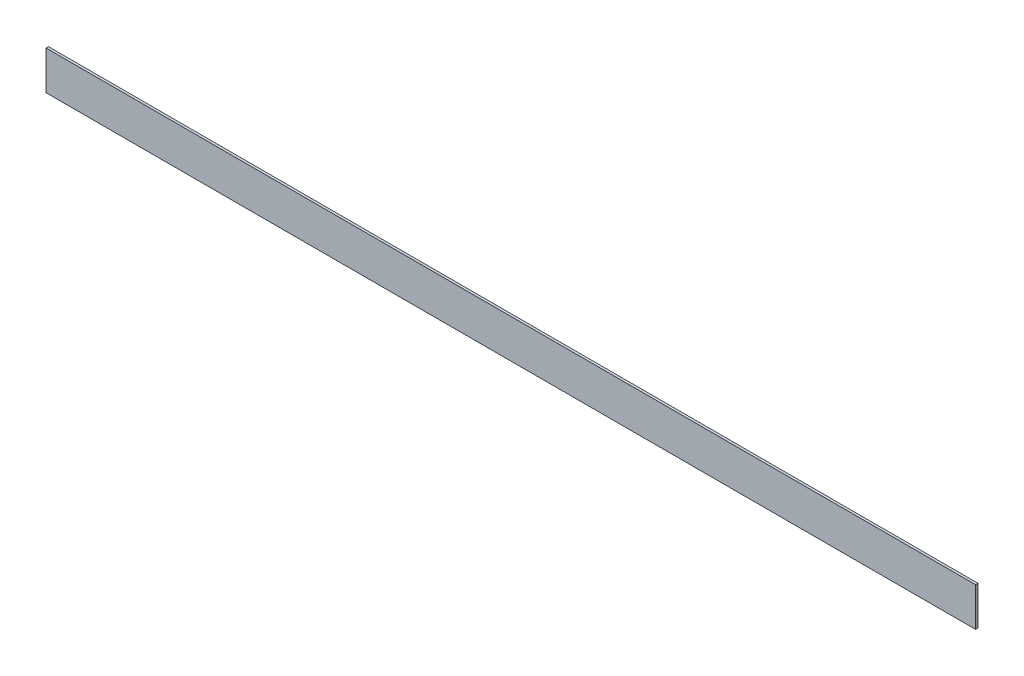
ISO-10303-21;
HEADER;
FILE_DESCRIPTION(('STEP AP214'),'2;1');
FILE_NAME('part.step','',(''),(''),'','','');
FILE_SCHEMA(('AUTOMOTIVE_DESIGN { 1 0 10303 214 1 1 1 1 }'));
ENDSEC;
DATA;
#1=APPLICATION_CONTEXT('core data for automotive mechanical design processes');
#2=APPLICATION_PROTOCOL_DEFINITION('international standard','automotive_design',2000,#1);
#3=PRODUCT_CONTEXT('',#1,'mechanical');
#4=PRODUCT('Part','Part','',(#3));
#5=PRODUCT_RELATED_PRODUCT_CATEGORY('part','',(#4));
#6=PRODUCT_DEFINITION_FORMATION('','',#4);
#7=PRODUCT_DEFINITION_CONTEXT('part definition',#1,'design');
#8=PRODUCT_DEFINITION('design','',#6,#7);
#9=PRODUCT_DEFINITION_SHAPE('','',#8);
#10=(LENGTH_UNIT() NAMED_UNIT(*) SI_UNIT(.MILLI.,.METRE.));
#11=(NAMED_UNIT(*) PLANE_ANGLE_UNIT() SI_UNIT($,.RADIAN.));
#12=(NAMED_UNIT(*) SI_UNIT($,.STERADIAN.) SOLID_ANGLE_UNIT());
#13=UNCERTAINTY_MEASURE_WITH_UNIT(LENGTH_MEASURE(1.E-05),#10,'distance_accuracy_value','');
#14=(GEOMETRIC_REPRESENTATION_CONTEXT(3) GLOBAL_UNCERTAINTY_ASSIGNED_CONTEXT((#13)) GLOBAL_UNIT_ASSIGNED_CONTEXT((#10,
#11,#12)) REPRESENTATION_CONTEXT('',''));
#15=CARTESIAN_POINT('',(0.,0.,0.));
#16=DIRECTION('',(0.,0.,1.));
#17=DIRECTION('',(1.,0.,0.));
#18=AXIS2_PLACEMENT_3D('',#15,#16,#17);
#19=CARTESIAN_POINT('',(304.8,12.7,1.58749999999985));
#20=DIRECTION('',(-1.,0.,0.));
#21=DIRECTION('',(0.,0.,1.));
#22=AXIS2_PLACEMENT_3D('',#19,#20,#21);
#23=PLANE('',#22);
#24=DIRECTION('',(0.,1.,0.));
#25=VECTOR('',#24,1.);
#26=CARTESIAN_POINT('',(304.8,12.7,0.));
#27=LINE('',#26,#25);
#28=CARTESIAN_POINT('',(304.8,-12.7,0.));
#29=VERTEX_POINT('',#28);
#30=CARTESIAN_POINT('',(304.8,12.7,0.));
#31=VERTEX_POINT('',#30);
#32=EDGE_CURVE('E95',#29,#31,#27,.T.);
#33=ORIENTED_EDGE('',*,*,#32,.T.);
#34=DIRECTION('',(0.,0.,-1.));
#35=VECTOR('',#34,1.);
#36=CARTESIAN_POINT('',(304.8,12.7,1.58749999999985));
#37=LINE('',#36,#35);
#38=CARTESIAN_POINT('',(304.8,12.7,1.58749999999985));
#39=VERTEX_POINT('',#38);
#40=EDGE_CURVE('E11',#39,#31,#37,.T.);
#41=ORIENTED_EDGE('',*,*,#40,.F.);
#42=DIRECTION('',(0.,1.,0.));
#43=VECTOR('',#42,1.);
#44=CARTESIAN_POINT('',(304.8,12.7,1.58749999999985));
#45=LINE('',#44,#43);
#46=CARTESIAN_POINT('',(304.8,-12.7,1.58749999999985));
#47=VERTEX_POINT('',#46);
#48=EDGE_CURVE('E83',#47,#39,#45,.T.);
#49=ORIENTED_EDGE('',*,*,#48,.F.);
#50=DIRECTION('',(0.,0.,-1.));
#51=VECTOR('',#50,1.);
#52=CARTESIAN_POINT('',(304.8,-12.7,1.58749999999985));
#53=LINE('',#52,#51);
#54=EDGE_CURVE('E91',#47,#29,#53,.T.);
#55=ORIENTED_EDGE('',*,*,#54,.T.);
#56=EDGE_LOOP('',(#33,#41,#49,#55));
#57=FACE_BOUND('',#56,.T.);
#58=ADVANCED_FACE('F32',(#57),#23,.F.);
#59=CARTESIAN_POINT('',(-304.8,12.7,1.58749999999985));
#60=DIRECTION('',(0.,-1.,0.));
#61=DIRECTION('',(0.,0.,-1.));
#62=AXIS2_PLACEMENT_3D('',#59,#60,#61);
#63=PLANE('',#62);
#64=DIRECTION('',(-1.,0.,0.));
#65=VECTOR('',#64,1.);
#66=CARTESIAN_POINT('',(-304.8,12.7,-2.22044604925031E-13));
#67=LINE('',#66,#65);
#68=CARTESIAN_POINT('',(-304.8,12.7,-2.22044604925031E-13));
#69=VERTEX_POINT('',#68);
#70=EDGE_CURVE('E87',#31,#69,#67,.T.);
#71=ORIENTED_EDGE('',*,*,#70,.T.);
#72=DIRECTION('',(0.,0.,-1.));
#73=VECTOR('',#72,1.);
#74=CARTESIAN_POINT('',(-304.8,12.7,1.58749999999985));
#75=LINE('',#74,#73);
#76=CARTESIAN_POINT('',(-304.8,12.7,1.58749999999985));
#77=VERTEX_POINT('',#76);
#78=EDGE_CURVE('E40',#77,#69,#75,.T.);
#79=ORIENTED_EDGE('',*,*,#78,.F.);
#80=DIRECTION('',(-1.,0.,0.));
#81=VECTOR('',#80,1.);
#82=CARTESIAN_POINT('',(-304.8,12.7,1.58749999999985));
#83=LINE('',#82,#81);
#84=EDGE_CURVE('E78',#39,#77,#83,.T.);
#85=ORIENTED_EDGE('',*,*,#84,.F.);
#86=ORIENTED_EDGE('',*,*,#40,.T.);
#87=EDGE_LOOP('',(#71,#79,#85,#86));
#88=FACE_BOUND('',#87,.T.);
#89=ADVANCED_FACE('F86',(#88),#63,.F.);
#90=CARTESIAN_POINT('',(-304.8,12.7,1.58749999999985));
#91=DIRECTION('',(1.,0.,0.));
#92=DIRECTION('',(0.,0.,-1.));
#93=AXIS2_PLACEMENT_3D('',#90,#91,#92);
#94=PLANE('',#93);
#95=DIRECTION('',(0.,-1.,0.));
#96=VECTOR('',#95,1.);
#97=CARTESIAN_POINT('',(-304.8,12.7,-2.22044604925031E-13));
#98=LINE('',#97,#96);
#99=CARTESIAN_POINT('',(-304.8,-12.7,-2.22044604925031E-13));
#100=VERTEX_POINT('',#99);
#101=EDGE_CURVE('E65',#69,#100,#98,.T.);
#102=ORIENTED_EDGE('',*,*,#101,.T.);
#103=DIRECTION('',(0.,0.,-1.));
#104=VECTOR('',#103,1.);
#105=CARTESIAN_POINT('',(-304.8,-12.7,1.58749999999985));
#106=LINE('',#105,#104);
#107=CARTESIAN_POINT('',(-304.8,-12.7,1.58749999999985));
#108=VERTEX_POINT('',#107);
#109=EDGE_CURVE('E88',#108,#100,#106,.T.);
#110=ORIENTED_EDGE('',*,*,#109,.F.);
#111=DIRECTION('',(0.,-1.,0.));
#112=VECTOR('',#111,1.);
#113=CARTESIAN_POINT('',(-304.8,12.7,1.58749999999985));
#114=LINE('',#113,#112);
#115=EDGE_CURVE('E81',#77,#108,#114,.T.);
#116=ORIENTED_EDGE('',*,*,#115,.F.);
#117=ORIENTED_EDGE('',*,*,#78,.T.);
#118=EDGE_LOOP('',(#102,#110,#116,#117));
#119=FACE_BOUND('',#118,.T.);
#120=ADVANCED_FACE('F89',(#119),#94,.F.);
#121=CARTESIAN_POINT('',(-304.8,-12.7,1.58749999999985));
#122=DIRECTION('',(0.,1.,0.));
#123=DIRECTION('',(0.,0.,1.));
#124=AXIS2_PLACEMENT_3D('',#121,#122,#123);
#125=PLANE('',#124);
#126=DIRECTION('',(1.,0.,0.));
#127=VECTOR('',#126,1.);
#128=CARTESIAN_POINT('',(-304.8,-12.7,-2.22044604925031E-13));
#129=LINE('',#128,#127);
#130=EDGE_CURVE('E71',#100,#29,#129,.T.);
#131=ORIENTED_EDGE('',*,*,#130,.T.);
#132=ORIENTED_EDGE('',*,*,#54,.F.);
#133=DIRECTION('',(1.,0.,0.));
#134=VECTOR('',#133,1.);
#135=CARTESIAN_POINT('',(-304.8,-12.7,1.58749999999985));
#136=LINE('',#135,#134);
#137=EDGE_CURVE('E48',#108,#47,#136,.T.);
#138=ORIENTED_EDGE('',*,*,#137,.F.);
#139=ORIENTED_EDGE('',*,*,#109,.T.);
#140=EDGE_LOOP('',(#131,#132,#138,#139));
#141=FACE_BOUND('',#140,.T.);
#142=ADVANCED_FACE('F102',(#141),#125,.F.);
#143=CARTESIAN_POINT('',(0.,0.,1.58749999999963));
#144=DIRECTION('',(0.,0.,1.));
#145=DIRECTION('',(1.,0.,0.));
#146=AXIS2_PLACEMENT_3D('',#143,#144,#145);
#147=PLANE('',#146);
#148=ORIENTED_EDGE('',*,*,#48,.T.);
#149=ORIENTED_EDGE('',*,*,#84,.T.);
#150=ORIENTED_EDGE('',*,*,#115,.T.);
#151=ORIENTED_EDGE('',*,*,#137,.T.);
#152=EDGE_LOOP('',(#148,#149,#150,#151));
#153=FACE_BOUND('',#152,.T.);
#154=ADVANCED_FACE('F79',(#153),#147,.T.);
#155=CARTESIAN_POINT('',(0.,0.,0.));
#156=DIRECTION('',(0.,0.,1.));
#157=DIRECTION('',(1.,0.,0.));
#158=AXIS2_PLACEMENT_3D('',#155,#156,#157);
#159=PLANE('',#158);
#160=ORIENTED_EDGE('',*,*,#32,.F.);
#161=ORIENTED_EDGE('',*,*,#130,.F.);
#162=ORIENTED_EDGE('',*,*,#101,.F.);
#163=ORIENTED_EDGE('',*,*,#70,.F.);
#164=EDGE_LOOP('',(#160,#161,#162,#163));
#165=FACE_BOUND('',#164,.T.);
#166=ADVANCED_FACE('F105',(#165),#159,.F.);
#167=CLOSED_SHELL('',(#58,#89,#120,#142,#154,#166));
#168=MANIFOLD_SOLID_BREP('B2',#167);
#169=ADVANCED_BREP_SHAPE_REPRESENTATION('',(#18,#168),#14);
#170=SHAPE_DEFINITION_REPRESENTATION(#9,#169);
ENDSEC;
END-ISO-10303-21;
